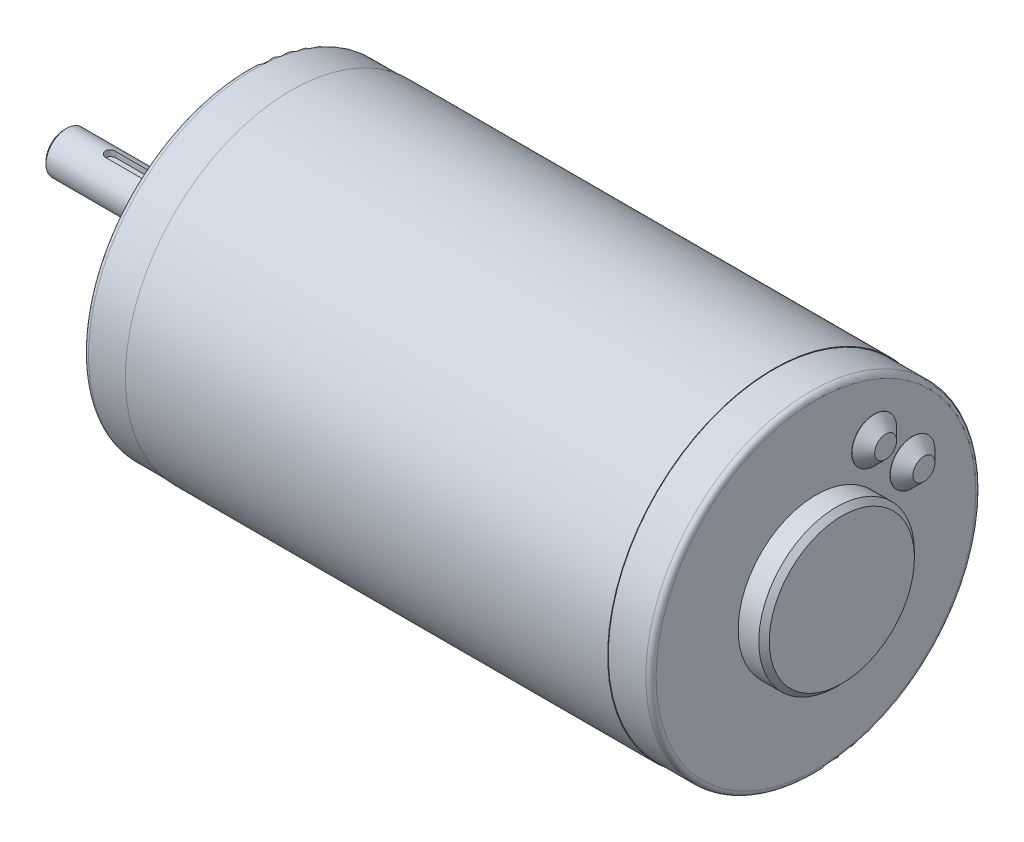
ISO-10303-21;
HEADER;
FILE_DESCRIPTION(('STEP AP214'),'2;1');
FILE_NAME('part.step','',(''),(''),'','','');
FILE_SCHEMA(('AUTOMOTIVE_DESIGN { 1 0 10303 214 1 1 1 1 }'));
ENDSEC;
DATA;
#1=APPLICATION_CONTEXT('core data for automotive mechanical design processes');
#2=APPLICATION_PROTOCOL_DEFINITION('international standard','automotive_design',2000,#1);
#3=PRODUCT_CONTEXT('',#1,'mechanical');
#4=PRODUCT('Part','Part','',(#3));
#5=PRODUCT_RELATED_PRODUCT_CATEGORY('part','',(#4));
#6=PRODUCT_DEFINITION_FORMATION('','',#4);
#7=PRODUCT_DEFINITION_CONTEXT('part definition',#1,'design');
#8=PRODUCT_DEFINITION('design','',#6,#7);
#9=PRODUCT_DEFINITION_SHAPE('','',#8);
#10=(LENGTH_UNIT() NAMED_UNIT(*) SI_UNIT(.MILLI.,.METRE.));
#11=(NAMED_UNIT(*) PLANE_ANGLE_UNIT() SI_UNIT($,.RADIAN.));
#12=(NAMED_UNIT(*) SI_UNIT($,.STERADIAN.) SOLID_ANGLE_UNIT());
#13=UNCERTAINTY_MEASURE_WITH_UNIT(LENGTH_MEASURE(1.E-05),#10,'distance_accuracy_value','');
#14=(GEOMETRIC_REPRESENTATION_CONTEXT(3) GLOBAL_UNCERTAINTY_ASSIGNED_CONTEXT((#13)) GLOBAL_UNIT_ASSIGNED_CONTEXT((#10,
#11,#12)) REPRESENTATION_CONTEXT('',''));
#15=CARTESIAN_POINT('',(0.,0.,0.));
#16=DIRECTION('',(0.,0.,1.));
#17=DIRECTION('',(1.,0.,0.));
#18=AXIS2_PLACEMENT_3D('',#15,#16,#17);
#19=CARTESIAN_POINT('',(-27.6,2.79999999999999,-1.));
#20=DIRECTION('',(0.,-1.,0.));
#21=DIRECTION('',(0.,0.,-1.));
#22=AXIS2_PLACEMENT_3D('',#19,#20,#21);
#23=PLANE('',#22);
#24=CARTESIAN_POINT('',(-7.1,2.79999999999999,0.));
#25=DIRECTION('',(0.,1.,0.));
#26=DIRECTION('',(0.,0.,1.));
#27=AXIS2_PLACEMENT_3D('',#24,#25,#26);
#28=CIRCLE('',#27,1.);
#29=CARTESIAN_POINT('',(-7.1,2.79999999999999,1.));
#30=VERTEX_POINT('',#29);
#31=CARTESIAN_POINT('',(-7.1,2.79999999999999,-1.));
#32=VERTEX_POINT('',#31);
#33=EDGE_CURVE('E79',#30,#32,#28,.T.);
#34=ORIENTED_EDGE('',*,*,#33,.T.);
#35=DIRECTION('',(1.,0.,0.));
#36=VECTOR('',#35,1.);
#37=CARTESIAN_POINT('',(-27.6,2.79999999999999,-1.));
#38=LINE('',#37,#36);
#39=CARTESIAN_POINT('',(-26.6,2.79999999999999,-1.));
#40=VERTEX_POINT('',#39);
#41=EDGE_CURVE('E74',#40,#32,#38,.T.);
#42=ORIENTED_EDGE('',*,*,#41,.F.);
#43=CARTESIAN_POINT('',(-26.6,2.79999999999999,0.));
#44=DIRECTION('',(0.,-1.,0.));
#45=DIRECTION('',(0.,0.,-1.));
#46=AXIS2_PLACEMENT_3D('',#43,#44,#45);
#47=CIRCLE('',#46,1.);
#48=CARTESIAN_POINT('',(-26.6,2.79999999999999,1.));
#49=VERTEX_POINT('',#48);
#50=EDGE_CURVE('E76',#40,#49,#47,.F.);
#51=ORIENTED_EDGE('',*,*,#50,.T.);
#52=DIRECTION('',(1.,0.,0.));
#53=VECTOR('',#52,1.);
#54=CARTESIAN_POINT('',(-27.6,2.79999999999999,1.));
#55=LINE('',#54,#53);
#56=EDGE_CURVE('E102',#49,#30,#55,.T.);
#57=ORIENTED_EDGE('',*,*,#56,.T.);
#58=EDGE_LOOP('',(#34,#42,#51,#57));
#59=FACE_BOUND('',#58,.T.);
#60=ADVANCED_FACE('F16',(#59),#23,.F.);
#61=CARTESIAN_POINT('',(-35.6,0.,0.));
#62=DIRECTION('',(-1.,0.,0.));
#63=DIRECTION('',(0.,0.,1.));
#64=AXIS2_PLACEMENT_3D('',#61,#62,#63);
#65=PLANE('',#64);
#66=CARTESIAN_POINT('',(-35.6000000000449,0.,0.));
#67=DIRECTION('',(1.,0.,0.));
#68=DIRECTION('',(0.,0.,-1.));
#69=AXIS2_PLACEMENT_3D('',#66,#67,#68);
#70=CIRCLE('',#69,3.49999999997408);
#71=CARTESIAN_POINT('',(-35.6000000000449,0.,-3.49999999997408));
#72=VERTEX_POINT('',#71);
#73=EDGE_CURVE('E326',#72,#72,#70,.T.);
#74=ORIENTED_EDGE('',*,*,#73,.F.);
#75=EDGE_LOOP('',(#74));
#76=FACE_BOUND('',#75,.T.);
#77=ADVANCED_FACE('F577',(#76),#65,.T.);
#78=CARTESIAN_POINT('',(-26.6,3.87298334620741,0.));
#79=DIRECTION('',(0.,-1.,0.));
#80=DIRECTION('',(0.,0.,-1.));
#81=AXIS2_PLACEMENT_3D('',#78,#79,#80);
#82=CYLINDRICAL_SURFACE('',#81,1.);
#83=CARTESIAN_POINT('',(-26.6,3.87298334620741,1.));
#84=CARTESIAN_POINT('',(-26.6276629851065,3.87298148580177,1.00000033749611));
#85=CARTESIAN_POINT('',(-26.6553122630182,3.8732800994947,0.998851407375366));
#86=CARTESIAN_POINT('',(-26.7104040353036,3.87445904774558,0.994271295395754));
#87=CARTESIAN_POINT('',(-26.7378465636871,3.87533928441687,0.990840497572679));
#88=CARTESIAN_POINT('',(-26.8194531732088,3.87881710972053,0.977175239382526));
#89=CARTESIAN_POINT('',(-26.8730564684822,3.88225203148808,0.963567695172493));
#90=CARTESIAN_POINT('',(-26.977124673782,3.89095422588002,0.927798076247996));
#91=CARTESIAN_POINT('',(-27.0275898782129,3.89622132630929,0.905636805423835));
#92=CARTESIAN_POINT('',(-27.1241114486473,3.90799134471939,0.853415378025864));
#93=CARTESIAN_POINT('',(-27.170166627891,3.91449459395647,0.823353103356932));
#94=CARTESIAN_POINT('',(-27.2575438819061,3.92816262398025,0.755484471828069));
#95=CARTESIAN_POINT('',(-27.2987548862455,3.93533791028915,0.717537268783975));
#96=CARTESIAN_POINT('',(-27.3743020894827,3.94945104396193,0.635275780516229));
#97=CARTESIAN_POINT('',(-27.4086371894679,3.95638885322537,0.59096047947883));
#98=CARTESIAN_POINT('',(-27.4699110016186,3.96936182283248,0.496456899401689));
#99=CARTESIAN_POINT('',(-27.496739895984,3.9753830468173,0.446195340334472));
#100=CARTESIAN_POINT('',(-27.5415247341967,3.98572346250588,0.341702590842916));
#101=CARTESIAN_POINT('',(-27.5594824242998,3.990042989147,0.287472184083007));
#102=CARTESIAN_POINT('',(-27.5856589927774,3.99641900005128,0.177744108525158));
#103=CARTESIAN_POINT('',(-27.5940676724228,3.998519529013,0.122294322002856));
#104=CARTESIAN_POINT('',(-27.6015033715433,4.00037438150815,0.0107327756816781));
#105=CARTESIAN_POINT('',(-27.6005315701923,4.00012899993444,-0.0453789000287067));
#106=CARTESIAN_POINT('',(-27.5893700363146,3.99735237365735,-0.155352492972096));
#107=CARTESIAN_POINT('',(-27.5793853834005,3.9948719867736,-0.209236701739855));
#108=CARTESIAN_POINT('',(-27.5508113208173,3.98796330636495,-0.31453871108434));
#109=CARTESIAN_POINT('',(-27.5322215304314,3.98353492665556,-0.365956402423988));
#110=CARTESIAN_POINT('',(-27.4867987193294,3.97314997761798,-0.46540728602454));
#111=CARTESIAN_POINT('',(-27.4598926057672,3.96717993827555,-0.513405629602248));
#112=CARTESIAN_POINT('',(-27.3986568701665,3.95435945541919,-0.604276631230015));
#113=CARTESIAN_POINT('',(-27.3643261297468,3.94750887933198,-0.64714851556229));
#114=CARTESIAN_POINT('',(-27.2881210879187,3.93345566022865,-0.727769389708492));
#115=CARTESIAN_POINT('',(-27.2460683634602,3.92624850477685,-0.765349103054128));
#116=CARTESIAN_POINT('',(-27.1561701330723,3.91246168284006,-0.832969575186237));
#117=CARTESIAN_POINT('',(-27.1083230467164,3.90588218842993,-0.863008270245062));
#118=CARTESIAN_POINT('',(-27.0078544021762,3.89407813586325,-0.914804709285961));
#119=CARTESIAN_POINT('',(-26.9552085351039,3.88886106009136,-0.936517017887269));
#120=CARTESIAN_POINT('',(-26.8468830715817,3.88047058807054,-0.970702351849828));
#121=CARTESIAN_POINT('',(-26.7912081448502,3.87729413761435,-0.983189189212131));
#122=CARTESIAN_POINT('',(-26.7125426192411,3.87455290681524,-0.993904635150938));
#123=CARTESIAN_POINT('',(-26.6900802967868,3.87396523110859,-0.996190790966708));
#124=CARTESIAN_POINT('',(-26.6450822100907,3.87318062488974,-0.999236757697394));
#125=CARTESIAN_POINT('',(-26.6225466240447,3.87298306219461,-0.999999038096045));
#126=CARTESIAN_POINT('',(-26.6,3.87298334620741,-1.));
#127=B_SPLINE_CURVE_WITH_KNOTS('',3,(#83,#84,#85,#86,#87,#88,#89,#90,#91,#92,#93,#94,#95,#96,
#97,#98,#99,#100,#101,#102,#103,#104,#105,#106,#107,#108,#109,#110,#111,#112,#113,#114,#115,
#116,#117,#118,#119,#120,#121,#122,#123,#124,#125,#126),.UNSPECIFIED.,.F.,.F.,(4,2,2,2,2,2,2,2,
2,2,2,2,2,2,2,2,2,2,2,2,2,4),(0.,0.0829365303397727,0.165859106084653,0.331229963080318,
0.496585282091499,0.661984974726751,0.830641897427976,0.999325753539196,1.17036187098235,
1.34136430732425,1.50890481515325,1.67642426256639,1.84022545479276,2.00403389475838,
2.16932509450376,2.33464120964329,2.50441429534542,2.67423379180967,2.84496720161068,
3.01544447539986,3.08315848722649,3.15076267731671),.UNSPECIFIED.);
#128=CARTESIAN_POINT('',(-26.6,3.87298334620741,1.));
#129=VERTEX_POINT('',#128);
#130=CARTESIAN_POINT('',(-26.6,3.87298334620741,-1.));
#131=VERTEX_POINT('',#130);
#132=EDGE_CURVE('E161',#129,#131,#127,.T.);
#133=ORIENTED_EDGE('',*,*,#132,.F.);
#134=DIRECTION('',(0.,1.,0.));
#135=VECTOR('',#134,1.);
#136=CARTESIAN_POINT('',(-26.6,2.79999999999999,1.));
#137=LINE('',#136,#135);
#138=EDGE_CURVE('E89',#129,#49,#137,.F.);
#139=ORIENTED_EDGE('',*,*,#138,.T.);
#140=ORIENTED_EDGE('',*,*,#50,.F.);
#141=DIRECTION('',(0.,1.,0.));
#142=VECTOR('',#141,1.);
#143=CARTESIAN_POINT('',(-26.6,2.79999999999999,-1.));
#144=LINE('',#143,#142);
#145=EDGE_CURVE('E83',#131,#40,#144,.F.);
#146=ORIENTED_EDGE('',*,*,#145,.F.);
#147=EDGE_LOOP('',(#133,#139,#140,#146));
#148=FACE_BOUND('',#147,.T.);
#149=ADVANCED_FACE('F86',(#148),#82,.F.);
#150=CARTESIAN_POINT('',(-27.6,2.79999999999999,-1.));
#151=DIRECTION('',(0.,0.,1.));
#152=DIRECTION('',(1.,0.,0.));
#153=AXIS2_PLACEMENT_3D('',#150,#151,#152);
#154=PLANE('',#153);
#155=DIRECTION('',(1.,0.,0.));
#156=VECTOR('',#155,1.);
#157=CARTESIAN_POINT('',(0.,3.87298334620741,-1.));
#158=LINE('',#157,#156);
#159=CARTESIAN_POINT('',(-7.1,3.87298334620741,-1.));
#160=VERTEX_POINT('',#159);
#161=EDGE_CURVE('E94',#131,#160,#158,.T.);
#162=ORIENTED_EDGE('',*,*,#161,.F.);
#163=ORIENTED_EDGE('',*,*,#145,.T.);
#164=ORIENTED_EDGE('',*,*,#41,.T.);
#165=DIRECTION('',(0.,1.,0.));
#166=VECTOR('',#165,1.);
#167=CARTESIAN_POINT('',(-7.1,2.79999999999999,-1.));
#168=LINE('',#167,#166);
#169=EDGE_CURVE('E97',#32,#160,#168,.T.);
#170=ORIENTED_EDGE('',*,*,#169,.T.);
#171=EDGE_LOOP('',(#162,#163,#164,#170));
#172=FACE_BOUND('',#171,.T.);
#173=ADVANCED_FACE('F92',(#172),#154,.T.);
#174=CARTESIAN_POINT('',(-7.1,2.79999999999999,0.));
#175=DIRECTION('',(0.,1.,0.));
#176=DIRECTION('',(0.,0.,1.));
#177=AXIS2_PLACEMENT_3D('',#174,#175,#176);
#178=CYLINDRICAL_SURFACE('',#177,1.);
#179=ORIENTED_EDGE('',*,*,#33,.F.);
#180=DIRECTION('',(0.,1.,0.));
#181=VECTOR('',#180,1.);
#182=CARTESIAN_POINT('',(-7.1,2.79999999999999,1.));
#183=LINE('',#182,#181);
#184=CARTESIAN_POINT('',(-7.1,3.87298334620741,1.));
#185=VERTEX_POINT('',#184);
#186=EDGE_CURVE('E103',#30,#185,#183,.T.);
#187=ORIENTED_EDGE('',*,*,#186,.T.);
#188=CARTESIAN_POINT('',(-7.1,3.87298334620741,-1.));
#189=CARTESIAN_POINT('',(-7.07233701489346,3.87298148580177,-1.00000033749611));
#190=CARTESIAN_POINT('',(-7.04468773698177,3.8732800994947,-0.998851407375366));
#191=CARTESIAN_POINT('',(-6.98959596469644,3.87445904774558,-0.994271295395754));
#192=CARTESIAN_POINT('',(-6.96215343631291,3.87533928441687,-0.990840497572679));
#193=CARTESIAN_POINT('',(-6.88054682679116,3.87881710972053,-0.977175239382526));
#194=CARTESIAN_POINT('',(-6.82694353151779,3.88225203148808,-0.963567695172493));
#195=CARTESIAN_POINT('',(-6.72287532621804,3.89095422588002,-0.927798076247997));
#196=CARTESIAN_POINT('',(-6.67241012178714,3.89622132630929,-0.905636805423836));
#197=CARTESIAN_POINT('',(-6.57588855135267,3.90799134471939,-0.853415378025865));
#198=CARTESIAN_POINT('',(-6.52983337210904,3.91449459395647,-0.823353103356933));
#199=CARTESIAN_POINT('',(-6.4424561180939,3.92816262398025,-0.755484471828069));
#200=CARTESIAN_POINT('',(-6.40124511375448,3.93533791028915,-0.717537268783976));
#201=CARTESIAN_POINT('',(-6.32569791051729,3.94945104396193,-0.63527578051623));
#202=CARTESIAN_POINT('',(-6.29136281053206,3.95638885322537,-0.590960479478831));
#203=CARTESIAN_POINT('',(-6.23008899838136,3.96936182283248,-0.496456899401691));
#204=CARTESIAN_POINT('',(-6.20326010401603,3.9753830468173,-0.446195340334474));
#205=CARTESIAN_POINT('',(-6.1584752658033,3.98572346250588,-0.341702590842919));
#206=CARTESIAN_POINT('',(-6.14051757570017,3.990042989147,-0.28747218408301));
#207=CARTESIAN_POINT('',(-6.11434100722257,3.99641900005128,-0.17774410852516));
#208=CARTESIAN_POINT('',(-6.10593232757718,3.998519529013,-0.122294322002858));
#209=CARTESIAN_POINT('',(-6.09849662845671,4.00037438150815,-0.0107327756816796));
#210=CARTESIAN_POINT('',(-6.09946842980766,4.00012899993444,0.0453789000287057));
#211=CARTESIAN_POINT('',(-6.11062996368545,3.99735237365735,0.155352492972096));
#212=CARTESIAN_POINT('',(-6.12061461659948,3.9948719867736,0.209236701739855));
#213=CARTESIAN_POINT('',(-6.14918867918275,3.98796330636495,0.31453871108434));
#214=CARTESIAN_POINT('',(-6.16777846956858,3.98353492665556,0.365956402423988));
#215=CARTESIAN_POINT('',(-6.21320128067065,3.97314997761798,0.465407286024539));
#216=CARTESIAN_POINT('',(-6.24010739423284,3.96717993827555,0.513405629602248));
#217=CARTESIAN_POINT('',(-6.30134312983347,3.95435945541919,0.604276631230014));
#218=CARTESIAN_POINT('',(-6.33567387025322,3.94750887933198,0.647148515562289));
#219=CARTESIAN_POINT('',(-6.41187891208131,3.93345566022865,0.72776938970849));
#220=CARTESIAN_POINT('',(-6.45393163653981,3.92624850477685,0.765349103054127));
#221=CARTESIAN_POINT('',(-6.54382986692773,3.91246168284006,0.832969575186237));
#222=CARTESIAN_POINT('',(-6.59167695328356,3.90588218842993,0.863008270245062));
#223=CARTESIAN_POINT('',(-6.69214559782377,3.89407813586325,0.914804709285962));
#224=CARTESIAN_POINT('',(-6.74479146489609,3.88886106009136,0.936517017887269));
#225=CARTESIAN_POINT('',(-6.85311692841829,3.88047058807055,0.970702351849829));
#226=CARTESIAN_POINT('',(-6.90879185514984,3.87729413761435,0.983189189212132));
#227=CARTESIAN_POINT('',(-6.9874573807589,3.87455290681524,0.993904635150938));
#228=CARTESIAN_POINT('',(-7.00991970321318,3.87396523110859,0.996190790966708));
#229=CARTESIAN_POINT('',(-7.05491778990932,3.87318062488974,0.999236757697394));
#230=CARTESIAN_POINT('',(-7.07745337595529,3.87298306219461,0.999999038096045));
#231=CARTESIAN_POINT('',(-7.1,3.87298334620741,1.));
#232=B_SPLINE_CURVE_WITH_KNOTS('',3,(#188,#189,#190,#191,#192,#193,#194,#195,#196,#197,#198,
#199,#200,#201,#202,#203,#204,#205,#206,#207,#208,#209,#210,#211,#212,#213,#214,#215,#216,#217,
#218,#219,#220,#221,#222,#223,#224,#225,#226,#227,#228,#229,#230,#231),.UNSPECIFIED.,.F.,.F.,(4,
2,2,2,2,2,2,2,2,2,2,2,2,2,2,2,2,2,2,2,2,4),(0.,0.0829365303397693,0.165859106084651,
0.331229963080317,0.496585282091498,0.661984974726749,0.830641897427974,0.999325753539193,
1.17036187098235,1.34136430732424,1.50890481515325,1.67642426256639,1.84022545479276,
2.00403389475838,2.16932509450376,2.33464120964329,2.50441429534542,2.67423379180967,
2.84496720161068,3.01544447539986,3.08315848722648,3.15076267731671),.UNSPECIFIED.);
#233=EDGE_CURVE('E151',#160,#185,#232,.T.);
#234=ORIENTED_EDGE('',*,*,#233,.F.);
#235=ORIENTED_EDGE('',*,*,#169,.F.);
#236=EDGE_LOOP('',(#179,#187,#234,#235));
#237=FACE_BOUND('',#236,.T.);
#238=ADVANCED_FACE('F168',(#237),#178,.F.);
#239=CARTESIAN_POINT('',(-27.6,2.79999999999999,1.));
#240=DIRECTION('',(0.,0.,1.));
#241=DIRECTION('',(1.,0.,0.));
#242=AXIS2_PLACEMENT_3D('',#239,#240,#241);
#243=PLANE('',#242);
#244=ORIENTED_EDGE('',*,*,#186,.F.);
#245=ORIENTED_EDGE('',*,*,#56,.F.);
#246=ORIENTED_EDGE('',*,*,#138,.F.);
#247=DIRECTION('',(1.,0.,0.));
#248=VECTOR('',#247,1.);
#249=CARTESIAN_POINT('',(0.,3.87298334620741,1.));
#250=LINE('',#249,#248);
#251=EDGE_CURVE('E160',#185,#129,#250,.F.);
#252=ORIENTED_EDGE('',*,*,#251,.F.);
#253=EDGE_LOOP('',(#244,#245,#246,#252));
#254=FACE_BOUND('',#253,.T.);
#255=ADVANCED_FACE('F183',(#254),#243,.F.);
#256=CARTESIAN_POINT('',(-35.0999999999999,0.,0.));
#257=DIRECTION('',(1.,0.,0.));
#258=DIRECTION('',(0.,0.,-1.));
#259=AXIS2_PLACEMENT_3D('',#256,#257,#258);
#260=CONICAL_SURFACE('',#259,3.99999999996226,0.785398163340605);
#261=ORIENTED_EDGE('',*,*,#73,.T.);
#262=EDGE_LOOP('',(#261));
#263=FACE_BOUND('',#262,.T.);
#264=CARTESIAN_POINT('',(-35.1,0.,0.));
#265=DIRECTION('',(1.,0.,0.));
#266=DIRECTION('',(0.,0.,-1.));
#267=AXIS2_PLACEMENT_3D('',#264,#265,#266);
#268=CIRCLE('',#267,4.);
#269=CARTESIAN_POINT('',(-35.1,0.,-4.));
#270=VERTEX_POINT('',#269);
#271=EDGE_CURVE('E150',#270,#270,#268,.T.);
#272=ORIENTED_EDGE('',*,*,#271,.F.);
#273=EDGE_LOOP('',(#272));
#274=FACE_BOUND('',#273,.T.);
#275=ADVANCED_FACE('F178',(#263,#274),#260,.T.);
#276=CARTESIAN_POINT('',(0.,0.,0.));
#277=DIRECTION('',(1.,0.,0.));
#278=DIRECTION('',(0.,0.,-1.));
#279=AXIS2_PLACEMENT_3D('',#276,#277,#278);
#280=CYLINDRICAL_SURFACE('',#279,4.);
#281=ORIENTED_EDGE('',*,*,#271,.T.);
#282=EDGE_LOOP('',(#281));
#283=FACE_BOUND('',#282,.T.);
#284=CARTESIAN_POINT('',(-4.,0.,0.));
#285=DIRECTION('',(1.,0.,0.));
#286=DIRECTION('',(0.,0.,-1.));
#287=AXIS2_PLACEMENT_3D('',#284,#285,#286);
#288=CIRCLE('',#287,4.);
#289=CARTESIAN_POINT('',(-4.,0.,-4.));
#290=VERTEX_POINT('',#289);
#291=EDGE_CURVE('E147',#290,#290,#288,.T.);
#292=ORIENTED_EDGE('',*,*,#291,.F.);
#293=EDGE_LOOP('',(#292));
#294=FACE_BOUND('',#293,.T.);
#295=ORIENTED_EDGE('',*,*,#233,.T.);
#296=ORIENTED_EDGE('',*,*,#251,.T.);
#297=ORIENTED_EDGE('',*,*,#132,.T.);
#298=ORIENTED_EDGE('',*,*,#161,.T.);
#299=EDGE_LOOP('',(#295,#296,#297,#298));
#300=FACE_BOUND('',#299,.T.);
#301=ADVANCED_FACE('F172',(#283,#294,#300),#280,.T.);
#302=CARTESIAN_POINT('',(-4.,4.,0.));
#303=DIRECTION('',(-1.,0.,0.));
#304=DIRECTION('',(0.,0.,1.));
#305=AXIS2_PLACEMENT_3D('',#302,#303,#304);
#306=PLANE('',#305);
#307=ORIENTED_EDGE('',*,*,#291,.T.);
#308=EDGE_LOOP('',(#307));
#309=FACE_BOUND('',#308,.T.);
#310=CARTESIAN_POINT('',(-4.,0.,0.));
#311=DIRECTION('',(1.,0.,0.));
#312=DIRECTION('',(0.,1.,0.));
#313=AXIS2_PLACEMENT_3D('',#310,#311,#312);
#314=CIRCLE('',#313,8.509);
#315=CARTESIAN_POINT('',(-4.,8.509,0.));
#316=VERTEX_POINT('',#315);
#317=EDGE_CURVE('E144',#316,#316,#314,.T.);
#318=ORIENTED_EDGE('',*,*,#317,.F.);
#319=EDGE_LOOP('',(#318));
#320=FACE_BOUND('',#319,.T.);
#321=ADVANCED_FACE('F177',(#309,#320),#306,.T.);
#322=CARTESIAN_POINT('',(111.8479,18.6070906828553,-11.2073596390943));
#323=DIRECTION('',(1.,0.,0.));
#324=DIRECTION('',(0.,0.,-1.));
#325=AXIS2_PLACEMENT_3D('',#322,#323,#324);
#326=PLANE('',#325);
#327=CARTESIAN_POINT('',(111.84789999993,18.6070906828553,-11.2073596390943));
#328=DIRECTION('',(-1.,0.,0.));
#329=DIRECTION('',(0.,-1.,0.));
#330=AXIS2_PLACEMENT_3D('',#327,#328,#329);
#331=CIRCLE('',#330,2.11800000003146);
#332=CARTESIAN_POINT('',(111.84789999993,16.4890906828238,-11.2073596390943));
#333=VERTEX_POINT('',#332);
#334=EDGE_CURVE('E141',#333,#333,#331,.T.);
#335=ORIENTED_EDGE('',*,*,#334,.F.);
#336=EDGE_LOOP('',(#335));
#337=FACE_BOUND('',#336,.T.);
#338=ADVANCED_FACE('F529',(#337),#326,.T.);
#339=CARTESIAN_POINT('',(114.6,15.0368,0.));
#340=DIRECTION('',(1.,0.,0.));
#341=DIRECTION('',(0.,0.,-1.));
#342=AXIS2_PLACEMENT_3D('',#339,#340,#341);
#343=PLANE('',#342);
#344=CARTESIAN_POINT('',(114.6,0.,0.));
#345=DIRECTION('',(-1.,0.,0.));
#346=DIRECTION('',(0.,-1.,0.));
#347=AXIS2_PLACEMENT_3D('',#344,#345,#346);
#348=CIRCLE('',#347,14.0208);
#349=CARTESIAN_POINT('',(114.6,-14.0208,0.));
#350=VERTEX_POINT('',#349);
#351=EDGE_CURVE('E138',#350,#350,#348,.T.);
#352=ORIENTED_EDGE('',*,*,#351,.F.);
#353=EDGE_LOOP('',(#352));
#354=FACE_BOUND('',#353,.T.);
#355=ADVANCED_FACE('F520',(#354),#343,.T.);
#356=CARTESIAN_POINT('',(111.8479,11.2073596390943,-18.6070906828553));
#357=DIRECTION('',(1.,0.,0.));
#358=DIRECTION('',(0.,0.,-1.));
#359=AXIS2_PLACEMENT_3D('',#356,#357,#358);
#360=PLANE('',#359);
#361=CARTESIAN_POINT('',(111.84789999993,11.2073596390943,-18.6070906828553));
#362=DIRECTION('',(-1.,0.,0.));
#363=DIRECTION('',(0.,0.,1.));
#364=AXIS2_PLACEMENT_3D('',#361,#362,#363);
#365=CIRCLE('',#364,2.1180000000021);
#366=CARTESIAN_POINT('',(111.84789999993,11.2073596390943,-16.4890906828532));
#367=VERTEX_POINT('',#366);
#368=EDGE_CURVE('E134',#367,#367,#365,.T.);
#369=ORIENTED_EDGE('',*,*,#368,.F.);
#370=EDGE_LOOP('',(#369));
#371=FACE_BOUND('',#370,.T.);
#372=ADVANCED_FACE('F511',(#371),#360,.T.);
#373=CARTESIAN_POINT('',(13.6143999999945,25.4,0.));
#374=DIRECTION('',(-1.,0.,0.));
#375=DIRECTION('',(0.,0.,1.));
#376=AXIS2_PLACEMENT_3D('',#373,#374,#375);
#377=CONICAL_SURFACE('',#376,2.01929999997219,1.02974425867198);
#378=CARTESIAN_POINT('',(14.827717847993,25.4,0.));
#379=VERTEX_POINT('',#378);
#380=VERTEX_LOOP('',#379);
#381=FACE_BOUND('',#380,.T.);
#382=CARTESIAN_POINT('',(13.6144,25.4,0.));
#383=DIRECTION('',(-1.,0.,0.));
#384=DIRECTION('',(0.,0.,1.));
#385=AXIS2_PLACEMENT_3D('',#382,#383,#384);
#386=CIRCLE('',#385,2.0193);
#387=CARTESIAN_POINT('',(13.6144,25.4,2.0193));
#388=VERTEX_POINT('',#387);
#389=EDGE_CURVE('E137',#388,#388,#386,.T.);
#390=ORIENTED_EDGE('',*,*,#389,.T.);
#391=EDGE_LOOP('',(#390));
#392=FACE_BOUND('',#391,.T.);
#393=ADVANCED_FACE('F502',(#381,#392),#377,.F.);
#394=CARTESIAN_POINT('',(13.6143999999945,-25.4,0.));
#395=DIRECTION('',(-1.,0.,0.));
#396=DIRECTION('',(0.,0.,1.));
#397=AXIS2_PLACEMENT_3D('',#394,#395,#396);
#398=CONICAL_SURFACE('',#397,2.01929999997219,1.02974425867198);
#399=CARTESIAN_POINT('',(14.827717847993,-25.4,0.));
#400=VERTEX_POINT('',#399);
#401=VERTEX_LOOP('',#400);
#402=FACE_BOUND('',#401,.T.);
#403=CARTESIAN_POINT('',(13.6144,-25.4,0.));
#404=DIRECTION('',(-1.,0.,0.));
#405=DIRECTION('',(0.,0.,1.));
#406=AXIS2_PLACEMENT_3D('',#403,#404,#405);
#407=CIRCLE('',#406,2.0193);
#408=CARTESIAN_POINT('',(13.6144,-25.4,2.0193));
#409=VERTEX_POINT('',#408);
#410=EDGE_CURVE('E316',#409,#409,#407,.T.);
#411=ORIENTED_EDGE('',*,*,#410,.T.);
#412=EDGE_LOOP('',(#411));
#413=FACE_BOUND('',#412,.T.);
#414=ADVANCED_FACE('F493',(#402,#413),#398,.F.);
#415=CARTESIAN_POINT('',(-2.984,0.,0.));
#416=DIRECTION('',(1.,0.,0.));
#417=DIRECTION('',(0.,1.,0.));
#418=AXIS2_PLACEMENT_3D('',#415,#416,#417);
#419=CONICAL_SURFACE('',#418,9.525,0.78539816339745);
#420=ORIENTED_EDGE('',*,*,#317,.T.);
#421=EDGE_LOOP('',(#420));
#422=FACE_BOUND('',#421,.T.);
#423=CARTESIAN_POINT('',(-2.984,0.,0.));
#424=DIRECTION('',(1.,0.,0.));
#425=DIRECTION('',(0.,0.,-1.));
#426=AXIS2_PLACEMENT_3D('',#423,#424,#425);
#427=CIRCLE('',#426,9.525);
#428=CARTESIAN_POINT('',(-2.984,0.,-9.525));
#429=VERTEX_POINT('',#428);
#430=EDGE_CURVE('E313',#429,#429,#427,.T.);
#431=ORIENTED_EDGE('',*,*,#430,.F.);
#432=EDGE_LOOP('',(#431));
#433=FACE_BOUND('',#432,.T.);
#434=ADVANCED_FACE('F484',(#422,#433),#419,.T.);
#435=CARTESIAN_POINT('',(109.647900000027,18.6070906828553,-11.2073596390943));
#436=DIRECTION('',(-1.,0.,0.));
#437=DIRECTION('',(0.,-1.,0.));
#438=AXIS2_PLACEMENT_3D('',#435,#436,#437);
#439=CONICAL_SURFACE('',#438,4.31799999987712,0.785398163384529);
#440=CARTESIAN_POINT('',(109.6479,18.6070906828553,-11.2073596390943));
#441=DIRECTION('',(-1.,0.,0.));
#442=DIRECTION('',(0.,0.,1.));
#443=AXIS2_PLACEMENT_3D('',#440,#441,#442);
#444=CIRCLE('',#443,4.318);
#445=CARTESIAN_POINT('',(109.6479,18.6070906828553,-6.88935963909434));
#446=VERTEX_POINT('',#445);
#447=EDGE_CURVE('E310',#446,#446,#444,.T.);
#448=ORIENTED_EDGE('',*,*,#447,.F.);
#449=EDGE_LOOP('',(#448));
#450=FACE_BOUND('',#449,.T.);
#451=ORIENTED_EDGE('',*,*,#334,.T.);
#452=EDGE_LOOP('',(#451));
#453=FACE_BOUND('',#452,.T.);
#454=ADVANCED_FACE('F475',(#450,#453),#439,.T.);
#455=CARTESIAN_POINT('',(113.584,0.,0.));
#456=DIRECTION('',(-1.,0.,0.));
#457=DIRECTION('',(0.,-1.,0.));
#458=AXIS2_PLACEMENT_3D('',#455,#456,#457);
#459=CONICAL_SURFACE('',#458,15.0368,0.785398163397441);
#460=ORIENTED_EDGE('',*,*,#351,.T.);
#461=EDGE_LOOP('',(#460));
#462=FACE_BOUND('',#461,.T.);
#463=CARTESIAN_POINT('',(113.584,0.,0.));
#464=DIRECTION('',(1.,0.,0.));
#465=DIRECTION('',(0.,0.,-1.));
#466=AXIS2_PLACEMENT_3D('',#463,#464,#465);
#467=CIRCLE('',#466,15.0368);
#468=CARTESIAN_POINT('',(113.584,0.,-15.0368));
#469=VERTEX_POINT('',#468);
#470=EDGE_CURVE('E307',#469,#469,#467,.F.);
#471=ORIENTED_EDGE('',*,*,#470,.F.);
#472=EDGE_LOOP('',(#471));
#473=FACE_BOUND('',#472,.T.);
#474=ADVANCED_FACE('F466',(#462,#473),#459,.T.);
#475=CARTESIAN_POINT('',(109.647900000084,11.2073596390943,-18.6070906828553));
#476=DIRECTION('',(-1.,0.,0.));
#477=DIRECTION('',(0.,0.,1.));
#478=AXIS2_PLACEMENT_3D('',#475,#476,#477);
#479=CONICAL_SURFACE('',#478,4.31799999990461,0.785398163410367);
#480=CARTESIAN_POINT('',(109.6479,11.2073596390943,-18.6070906828553));
#481=DIRECTION('',(-1.,0.,0.));
#482=DIRECTION('',(0.,0.,1.));
#483=AXIS2_PLACEMENT_3D('',#480,#481,#482);
#484=CIRCLE('',#483,4.318);
#485=CARTESIAN_POINT('',(109.6479,11.2073596390943,-14.2890906828553));
#486=VERTEX_POINT('',#485);
#487=EDGE_CURVE('E133',#486,#486,#484,.T.);
#488=ORIENTED_EDGE('',*,*,#487,.F.);
#489=EDGE_LOOP('',(#488));
#490=FACE_BOUND('',#489,.T.);
#491=ORIENTED_EDGE('',*,*,#368,.T.);
#492=EDGE_LOOP('',(#491));
#493=FACE_BOUND('',#492,.T.);
#494=ADVANCED_FACE('F457',(#490,#493),#479,.T.);
#495=CARTESIAN_POINT('',(0.,25.4,0.));
#496=DIRECTION('',(-1.,0.,0.));
#497=DIRECTION('',(0.,0.,1.));
#498=AXIS2_PLACEMENT_3D('',#495,#496,#497);
#499=CYLINDRICAL_SURFACE('',#498,2.0193);
#500=CARTESIAN_POINT('',(0.,25.4,0.));
#501=DIRECTION('',(-1.,0.,0.));
#502=DIRECTION('',(0.,0.,1.));
#503=AXIS2_PLACEMENT_3D('',#500,#501,#502);
#504=CIRCLE('',#503,2.0193);
#505=CARTESIAN_POINT('',(0.,25.4,2.0193));
#506=VERTEX_POINT('',#505);
#507=EDGE_CURVE('E130',#506,#506,#504,.F.);
#508=ORIENTED_EDGE('',*,*,#507,.F.);
#509=EDGE_LOOP('',(#508));
#510=FACE_BOUND('',#509,.T.);
#511=ORIENTED_EDGE('',*,*,#389,.F.);
#512=EDGE_LOOP('',(#511));
#513=FACE_BOUND('',#512,.T.);
#514=ADVANCED_FACE('F448',(#510,#513),#499,.F.);
#515=CARTESIAN_POINT('',(0.,-25.4,0.));
#516=DIRECTION('',(-1.,0.,0.));
#517=DIRECTION('',(0.,0.,1.));
#518=AXIS2_PLACEMENT_3D('',#515,#516,#517);
#519=CYLINDRICAL_SURFACE('',#518,2.0193);
#520=CARTESIAN_POINT('',(0.,-25.4,0.));
#521=DIRECTION('',(-1.,0.,0.));
#522=DIRECTION('',(0.,0.,1.));
#523=AXIS2_PLACEMENT_3D('',#520,#521,#522);
#524=CIRCLE('',#523,2.0193);
#525=CARTESIAN_POINT('',(0.,-25.4,2.0193));
#526=VERTEX_POINT('',#525);
#527=EDGE_CURVE('E127',#526,#526,#524,.F.);
#528=ORIENTED_EDGE('',*,*,#527,.F.);
#529=EDGE_LOOP('',(#528));
#530=FACE_BOUND('',#529,.T.);
#531=ORIENTED_EDGE('',*,*,#410,.F.);
#532=EDGE_LOOP('',(#531));
#533=FACE_BOUND('',#532,.T.);
#534=ADVANCED_FACE('F439',(#530,#533),#519,.F.);
#535=CARTESIAN_POINT('',(0.,0.,0.));
#536=DIRECTION('',(1.,0.,0.));
#537=DIRECTION('',(0.,0.,-1.));
#538=AXIS2_PLACEMENT_3D('',#535,#536,#537);
#539=CYLINDRICAL_SURFACE('',#538,9.525);
#540=ORIENTED_EDGE('',*,*,#430,.T.);
#541=EDGE_LOOP('',(#540));
#542=FACE_BOUND('',#541,.T.);
#543=CARTESIAN_POINT('',(0.,0.,0.));
#544=DIRECTION('',(1.,0.,0.));
#545=DIRECTION('',(0.,0.,-1.));
#546=AXIS2_PLACEMENT_3D('',#543,#544,#545);
#547=CIRCLE('',#546,9.525);
#548=CARTESIAN_POINT('',(0.,0.,-9.525));
#549=VERTEX_POINT('',#548);
#550=EDGE_CURVE('E124',#549,#549,#547,.T.);
#551=ORIENTED_EDGE('',*,*,#550,.F.);
#552=EDGE_LOOP('',(#551));
#553=FACE_BOUND('',#552,.T.);
#554=ADVANCED_FACE('F430',(#542,#553),#539,.T.);
#555=CARTESIAN_POINT('',(111.8479,18.6070906828553,-11.2073596390943));
#556=DIRECTION('',(-1.,0.,0.));
#557=DIRECTION('',(0.,0.,1.));
#558=AXIS2_PLACEMENT_3D('',#555,#556,#557);
#559=CYLINDRICAL_SURFACE('',#558,4.318);
#560=CARTESIAN_POINT('',(109.6,18.6070906828553,-11.2073596390943));
#561=DIRECTION('',(-1.,0.,0.));
#562=DIRECTION('',(0.,0.,1.));
#563=AXIS2_PLACEMENT_3D('',#560,#561,#562);
#564=CIRCLE('',#563,4.318);
#565=CARTESIAN_POINT('',(109.6,18.6070906828553,-6.88935963909434));
#566=VERTEX_POINT('',#565);
#567=EDGE_CURVE('E121',#566,#566,#564,.T.);
#568=ORIENTED_EDGE('',*,*,#567,.F.);
#569=EDGE_LOOP('',(#568));
#570=FACE_BOUND('',#569,.T.);
#571=ORIENTED_EDGE('',*,*,#447,.T.);
#572=EDGE_LOOP('',(#571));
#573=FACE_BOUND('',#572,.T.);
#574=ADVANCED_FACE('F421',(#570,#573),#559,.T.);
#575=CARTESIAN_POINT('',(0.,0.,0.));
#576=DIRECTION('',(1.,0.,0.));
#577=DIRECTION('',(0.,0.,-1.));
#578=AXIS2_PLACEMENT_3D('',#575,#576,#577);
#579=CYLINDRICAL_SURFACE('',#578,15.0368);
#580=CARTESIAN_POINT('',(109.6,0.,0.));
#581=DIRECTION('',(1.,0.,0.));
#582=DIRECTION('',(0.,0.,-1.));
#583=AXIS2_PLACEMENT_3D('',#580,#581,#582);
#584=CIRCLE('',#583,15.0368);
#585=CARTESIAN_POINT('',(109.6,0.,-15.0368));
#586=VERTEX_POINT('',#585);
#587=EDGE_CURVE('E118',#586,#586,#584,.F.);
#588=ORIENTED_EDGE('',*,*,#587,.F.);
#589=EDGE_LOOP('',(#588));
#590=FACE_BOUND('',#589,.T.);
#591=ORIENTED_EDGE('',*,*,#470,.T.);
#592=EDGE_LOOP('',(#591));
#593=FACE_BOUND('',#592,.T.);
#594=ADVANCED_FACE('F413',(#590,#593),#579,.T.);
#595=CARTESIAN_POINT('',(111.8479,11.2073596390943,-18.6070906828553));
#596=DIRECTION('',(-1.,0.,0.));
#597=DIRECTION('',(0.,0.,1.));
#598=AXIS2_PLACEMENT_3D('',#595,#596,#597);
#599=CYLINDRICAL_SURFACE('',#598,4.318);
#600=CARTESIAN_POINT('',(109.6,11.2073596390943,-18.6070906828553));
#601=DIRECTION('',(-1.,0.,0.));
#602=DIRECTION('',(0.,0.,1.));
#603=AXIS2_PLACEMENT_3D('',#600,#601,#602);
#604=CIRCLE('',#603,4.318);
#605=CARTESIAN_POINT('',(109.6,11.2073596390943,-14.2890906828553));
#606=VERTEX_POINT('',#605);
#607=EDGE_CURVE('E114',#606,#606,#604,.T.);
#608=ORIENTED_EDGE('',*,*,#607,.F.);
#609=EDGE_LOOP('',(#608));
#610=FACE_BOUND('',#609,.T.);
#611=ORIENTED_EDGE('',*,*,#487,.T.);
#612=EDGE_LOOP('',(#611));
#613=FACE_BOUND('',#612,.T.);
#614=ADVANCED_FACE('F405',(#610,#613),#599,.T.);
#615=CARTESIAN_POINT('',(0.,9.525,0.));
#616=DIRECTION('',(-1.,0.,0.));
#617=DIRECTION('',(0.,0.,1.));
#618=AXIS2_PLACEMENT_3D('',#615,#616,#617);
#619=PLANE('',#618);
#620=ORIENTED_EDGE('',*,*,#550,.T.);
#621=EDGE_LOOP('',(#620));
#622=FACE_BOUND('',#621,.T.);
#623=CARTESIAN_POINT('',(0.,0.,0.));
#624=DIRECTION('',(1.,0.,0.));
#625=DIRECTION('',(0.,0.,-1.));
#626=AXIS2_PLACEMENT_3D('',#623,#624,#625);
#627=CIRCLE('',#626,30.877);
#628=CARTESIAN_POINT('',(0.,0.,-30.877));
#629=VERTEX_POINT('',#628);
#630=CARTESIAN_POINT('',(0.,0.,30.877));
#631=VERTEX_POINT('',#630);
#632=EDGE_CURVE('E117',#629,#631,#627,.T.);
#633=ORIENTED_EDGE('',*,*,#632,.F.);
#634=CARTESIAN_POINT('',(0.,0.,0.));
#635=DIRECTION('',(1.,0.,0.));
#636=DIRECTION('',(0.,0.,1.));
#637=AXIS2_PLACEMENT_3D('',#634,#635,#636);
#638=CIRCLE('',#637,30.877);
#639=EDGE_CURVE('E286',#631,#629,#638,.T.);
#640=ORIENTED_EDGE('',*,*,#639,.F.);
#641=EDGE_LOOP('',(#633,#640));
#642=FACE_BOUND('',#641,.T.);
#643=ORIENTED_EDGE('',*,*,#527,.T.);
#644=EDGE_LOOP('',(#643));
#645=FACE_BOUND('',#644,.T.);
#646=ORIENTED_EDGE('',*,*,#507,.T.);
#647=EDGE_LOOP('',(#646));
#648=FACE_BOUND('',#647,.T.);
#649=ADVANCED_FACE('F252',(#622,#642,#645,#648),#619,.T.);
#650=CARTESIAN_POINT('',(109.6,31.877,0.));
#651=DIRECTION('',(1.,0.,0.));
#652=DIRECTION('',(0.,0.,-1.));
#653=AXIS2_PLACEMENT_3D('',#650,#651,#652);
#654=PLANE('',#653);
#655=ORIENTED_EDGE('',*,*,#607,.T.);
#656=EDGE_LOOP('',(#655));
#657=FACE_BOUND('',#656,.T.);
#658=ORIENTED_EDGE('',*,*,#587,.T.);
#659=EDGE_LOOP('',(#658));
#660=FACE_BOUND('',#659,.T.);
#661=CARTESIAN_POINT('',(109.6,0.,0.));
#662=DIRECTION('',(-1.,0.,0.));
#663=DIRECTION('',(0.,0.,1.));
#664=AXIS2_PLACEMENT_3D('',#661,#662,#663);
#665=CIRCLE('',#664,30.877);
#666=CARTESIAN_POINT('',(109.6,0.,30.877));
#667=VERTEX_POINT('',#666);
#668=CARTESIAN_POINT('',(109.6,0.,-30.877));
#669=VERTEX_POINT('',#668);
#670=EDGE_CURVE('E35',#667,#669,#665,.T.);
#671=ORIENTED_EDGE('',*,*,#670,.F.);
#672=CARTESIAN_POINT('',(109.6,0.,0.));
#673=DIRECTION('',(-1.,0.,0.));
#674=DIRECTION('',(0.,0.,-1.));
#675=AXIS2_PLACEMENT_3D('',#672,#673,#674);
#676=CIRCLE('',#675,30.877);
#677=EDGE_CURVE('E234',#669,#667,#676,.T.);
#678=ORIENTED_EDGE('',*,*,#677,.F.);
#679=EDGE_LOOP('',(#671,#678));
#680=FACE_BOUND('',#679,.T.);
#681=ORIENTED_EDGE('',*,*,#567,.T.);
#682=EDGE_LOOP('',(#681));
#683=FACE_BOUND('',#682,.T.);
#684=ADVANCED_FACE('F243',(#657,#660,#680,#683),#654,.T.);
#685=CARTESIAN_POINT('',(0.999999999999999,0.,0.));
#686=DIRECTION('',(-1.,0.,0.));
#687=DIRECTION('',(0.,0.,1.));
#688=AXIS2_PLACEMENT_3D('',#685,#686,#687);
#689=TOROIDAL_SURFACE('',#688,30.877,1.);
#690=CARTESIAN_POINT('',(0.999999999999999,0.,0.));
#691=DIRECTION('',(1.,0.,0.));
#692=DIRECTION('',(0.,0.,-1.));
#693=AXIS2_PLACEMENT_3D('',#690,#691,#692);
#694=CIRCLE('',#693,31.877);
#695=CARTESIAN_POINT('',(0.999999999999999,0.,-31.877));
#696=VERTEX_POINT('',#695);
#697=EDGE_CURVE('E232',#696,#696,#694,.T.);
#698=ORIENTED_EDGE('',*,*,#697,.F.);
#699=EDGE_LOOP('',(#698));
#700=FACE_BOUND('',#699,.T.);
#701=ORIENTED_EDGE('',*,*,#639,.T.);
#702=ORIENTED_EDGE('',*,*,#632,.T.);
#703=EDGE_LOOP('',(#701,#702));
#704=FACE_BOUND('',#703,.T.);
#705=ADVANCED_FACE('F221',(#700,#704),#689,.T.);
#706=CARTESIAN_POINT('',(108.6,0.,0.));
#707=DIRECTION('',(1.,0.,0.));
#708=DIRECTION('',(0.,0.,-1.));
#709=AXIS2_PLACEMENT_3D('',#706,#707,#708);
#710=TOROIDAL_SURFACE('',#709,30.877,1.);
#711=CARTESIAN_POINT('',(108.6,0.,0.));
#712=DIRECTION('',(1.,0.,0.));
#713=DIRECTION('',(0.,0.,-1.));
#714=AXIS2_PLACEMENT_3D('',#711,#712,#713);
#715=CIRCLE('',#714,31.877);
#716=CARTESIAN_POINT('',(108.6,0.,-31.877));
#717=VERTEX_POINT('',#716);
#718=EDGE_CURVE('E113',#717,#717,#715,.F.);
#719=ORIENTED_EDGE('',*,*,#718,.F.);
#720=EDGE_LOOP('',(#719));
#721=FACE_BOUND('',#720,.T.);
#722=ORIENTED_EDGE('',*,*,#677,.T.);
#723=ORIENTED_EDGE('',*,*,#670,.T.);
#724=EDGE_LOOP('',(#722,#723));
#725=FACE_BOUND('',#724,.T.);
#726=ADVANCED_FACE('F216',(#721,#725),#710,.T.);
#727=CARTESIAN_POINT('',(0.,0.,0.));
#728=DIRECTION('',(1.,0.,0.));
#729=DIRECTION('',(0.,0.,-1.));
#730=AXIS2_PLACEMENT_3D('',#727,#728,#729);
#731=CYLINDRICAL_SURFACE('',#730,31.877);
#732=ORIENTED_EDGE('',*,*,#697,.T.);
#733=EDGE_LOOP('',(#732));
#734=FACE_BOUND('',#733,.T.);
#735=CARTESIAN_POINT('',(8.2296,0.,0.));
#736=DIRECTION('',(1.,0.,0.));
#737=DIRECTION('',(0.,0.,-1.));
#738=AXIS2_PLACEMENT_3D('',#735,#736,#737);
#739=CIRCLE('',#738,31.877);
#740=CARTESIAN_POINT('',(8.2296,0.,-31.877));
#741=VERTEX_POINT('',#740);
#742=EDGE_CURVE('E110',#741,#741,#739,.T.);
#743=ORIENTED_EDGE('',*,*,#742,.F.);
#744=EDGE_LOOP('',(#743));
#745=FACE_BOUND('',#744,.T.);
#746=ADVANCED_FACE('F212',(#734,#745),#731,.T.);
#747=CARTESIAN_POINT('',(0.,0.,0.));
#748=DIRECTION('',(1.,0.,0.));
#749=DIRECTION('',(0.,0.,-1.));
#750=AXIS2_PLACEMENT_3D('',#747,#748,#749);
#751=CYLINDRICAL_SURFACE('',#750,31.877);
#752=CARTESIAN_POINT('',(101.3704,0.,0.));
#753=DIRECTION('',(1.,0.,0.));
#754=DIRECTION('',(0.,0.,-1.));
#755=AXIS2_PLACEMENT_3D('',#752,#753,#754);
#756=CIRCLE('',#755,31.877);
#757=CARTESIAN_POINT('',(101.3704,0.,-31.877));
#758=VERTEX_POINT('',#757);
#759=EDGE_CURVE('E107',#758,#758,#756,.F.);
#760=ORIENTED_EDGE('',*,*,#759,.F.);
#761=EDGE_LOOP('',(#760));
#762=FACE_BOUND('',#761,.T.);
#763=ORIENTED_EDGE('',*,*,#718,.T.);
#764=EDGE_LOOP('',(#763));
#765=FACE_BOUND('',#764,.T.);
#766=ADVANCED_FACE('F208',(#762,#765),#751,.T.);
#767=CARTESIAN_POINT('',(8.2296,31.877,0.));
#768=DIRECTION('',(-1.,0.,0.));
#769=DIRECTION('',(0.,0.,1.));
#770=AXIS2_PLACEMENT_3D('',#767,#768,#769);
#771=PLANE('',#770);
#772=CARTESIAN_POINT('',(8.2296,0.,0.));
#773=DIRECTION('',(1.,0.,0.));
#774=DIRECTION('',(0.,0.,-1.));
#775=AXIS2_PLACEMENT_3D('',#772,#773,#774);
#776=CIRCLE('',#775,32.004);
#777=CARTESIAN_POINT('',(8.2296,0.,-32.004));
#778=VERTEX_POINT('',#777);
#779=EDGE_CURVE('E27',#778,#778,#776,.T.);
#780=ORIENTED_EDGE('',*,*,#779,.F.);
#781=EDGE_LOOP('',(#780));
#782=FACE_BOUND('',#781,.T.);
#783=ORIENTED_EDGE('',*,*,#742,.T.);
#784=EDGE_LOOP('',(#783));
#785=FACE_BOUND('',#784,.T.);
#786=ADVANCED_FACE('F201',(#782,#785),#771,.T.);
#787=CARTESIAN_POINT('',(101.3704,32.004,0.));
#788=DIRECTION('',(1.,0.,0.));
#789=DIRECTION('',(0.,0.,-1.));
#790=AXIS2_PLACEMENT_3D('',#787,#788,#789);
#791=PLANE('',#790);
#792=ORIENTED_EDGE('',*,*,#759,.T.);
#793=EDGE_LOOP('',(#792));
#794=FACE_BOUND('',#793,.T.);
#795=CARTESIAN_POINT('',(101.3704,0.,0.));
#796=DIRECTION('',(1.,0.,0.));
#797=DIRECTION('',(0.,0.,-1.));
#798=AXIS2_PLACEMENT_3D('',#795,#796,#797);
#799=CIRCLE('',#798,32.004);
#800=CARTESIAN_POINT('',(101.3704,0.,-32.004));
#801=VERTEX_POINT('',#800);
#802=EDGE_CURVE('E11',#801,#801,#799,.F.);
#803=ORIENTED_EDGE('',*,*,#802,.F.);
#804=EDGE_LOOP('',(#803));
#805=FACE_BOUND('',#804,.T.);
#806=ADVANCED_FACE('F195',(#794,#805),#791,.T.);
#807=CARTESIAN_POINT('',(0.,0.,0.));
#808=DIRECTION('',(1.,0.,0.));
#809=DIRECTION('',(0.,0.,-1.));
#810=AXIS2_PLACEMENT_3D('',#807,#808,#809);
#811=CYLINDRICAL_SURFACE('',#810,32.004);
#812=ORIENTED_EDGE('',*,*,#802,.T.);
#813=EDGE_LOOP('',(#812));
#814=FACE_BOUND('',#813,.T.);
#815=ORIENTED_EDGE('',*,*,#779,.T.);
#816=EDGE_LOOP('',(#815));
#817=FACE_BOUND('',#816,.T.);
#818=ADVANCED_FACE('F193',(#814,#817),#811,.T.);
#819=CLOSED_SHELL('',(#60,#77,#149,#173,#238,#255,#275,#301,#321,#338,#355,#372,#393,#414,#434,
#454,#474,#494,#514,#534,#554,#574,#594,#614,#649,#684,#705,#726,#746,#766,#786,#806,#818));
#820=MANIFOLD_SOLID_BREP('B1',#819);
#821=ADVANCED_BREP_SHAPE_REPRESENTATION('',(#18,#820),#14);
#822=SHAPE_DEFINITION_REPRESENTATION(#9,#821);
ENDSEC;
END-ISO-10303-21;
